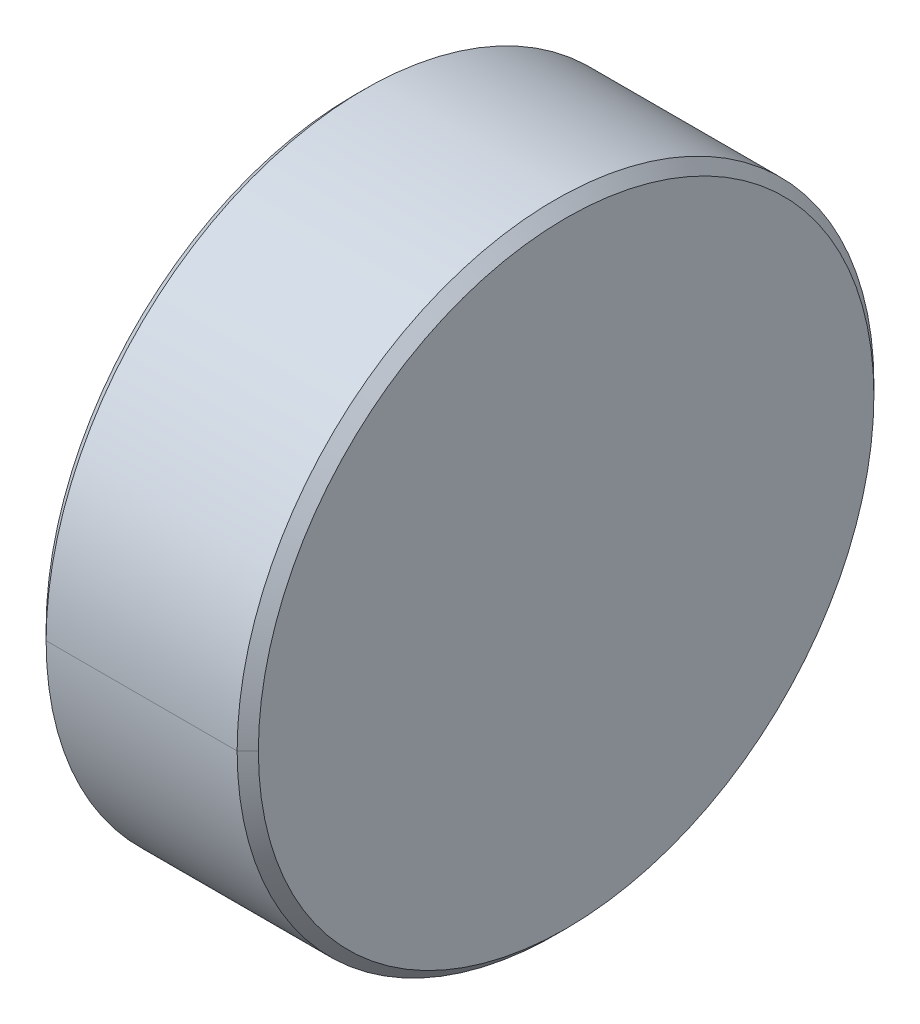
ISO-10303-21;
HEADER;
FILE_DESCRIPTION(('STEP AP214'),'2;1');
FILE_NAME('part.step','',(''),(''),'','','');
FILE_SCHEMA(('AUTOMOTIVE_DESIGN { 1 0 10303 214 1 1 1 1 }'));
ENDSEC;
DATA;
#1=APPLICATION_CONTEXT('core data for automotive mechanical design processes');
#2=APPLICATION_PROTOCOL_DEFINITION('international standard','automotive_design',2000,#1);
#3=PRODUCT_CONTEXT('',#1,'mechanical');
#4=PRODUCT('Part','Part','',(#3));
#5=PRODUCT_RELATED_PRODUCT_CATEGORY('part','',(#4));
#6=PRODUCT_DEFINITION_FORMATION('','',#4);
#7=PRODUCT_DEFINITION_CONTEXT('part definition',#1,'design');
#8=PRODUCT_DEFINITION('design','',#6,#7);
#9=PRODUCT_DEFINITION_SHAPE('','',#8);
#10=(LENGTH_UNIT() NAMED_UNIT(*) SI_UNIT(.MILLI.,.METRE.));
#11=(NAMED_UNIT(*) PLANE_ANGLE_UNIT() SI_UNIT($,.RADIAN.));
#12=(NAMED_UNIT(*) SI_UNIT($,.STERADIAN.) SOLID_ANGLE_UNIT());
#13=UNCERTAINTY_MEASURE_WITH_UNIT(LENGTH_MEASURE(1.E-05),#10,'distance_accuracy_value','');
#14=(GEOMETRIC_REPRESENTATION_CONTEXT(3) GLOBAL_UNCERTAINTY_ASSIGNED_CONTEXT((#13)) GLOBAL_UNIT_ASSIGNED_CONTEXT((#10,
#11,#12)) REPRESENTATION_CONTEXT('',''));
#15=CARTESIAN_POINT('',(0.,0.,0.));
#16=DIRECTION('',(0.,0.,1.));
#17=DIRECTION('',(1.,0.,0.));
#18=AXIS2_PLACEMENT_3D('',#15,#16,#17);
#19=CARTESIAN_POINT('',(0.95,0.,0.));
#20=DIRECTION('',(-1.,0.,0.));
#21=DIRECTION('',(0.,-1.,0.));
#22=AXIS2_PLACEMENT_3D('',#19,#20,#21);
#23=CONICAL_SURFACE('',#22,1.5,0.7853981634);
#24=CARTESIAN_POINT('',(1.,0.,0.));
#25=DIRECTION('',(1.,0.,0.));
#26=DIRECTION('',(0.,0.,-1.));
#27=AXIS2_PLACEMENT_3D('',#24,#25,#26);
#28=CIRCLE('',#27,1.45);
#29=CARTESIAN_POINT('',(1.,0.,-1.45));
#30=VERTEX_POINT('',#29);
#31=CARTESIAN_POINT('',(0.999999999999873,0.,1.44999999999987));
#32=VERTEX_POINT('',#31);
#33=EDGE_CURVE('E11',#30,#32,#28,.T.);
#34=ORIENTED_EDGE('',*,*,#33,.F.);
#35=DIRECTION('',(-0.707106781184743,0.,-0.707106781188352));
#36=VECTOR('',#35,1.);
#37=CARTESIAN_POINT('',(0.999999999999873,0.,-1.44999999999987));
#38=LINE('',#37,#36);
#39=CARTESIAN_POINT('',(0.95,0.,-1.5));
#40=VERTEX_POINT('',#39);
#41=EDGE_CURVE('E24',#30,#40,#38,.T.);
#42=ORIENTED_EDGE('',*,*,#41,.T.);
#43=CARTESIAN_POINT('',(0.95,0.,0.));
#44=DIRECTION('',(1.,0.,0.));
#45=DIRECTION('',(0.,0.,-1.));
#46=AXIS2_PLACEMENT_3D('',#43,#44,#45);
#47=CIRCLE('',#46,1.5);
#48=CARTESIAN_POINT('',(0.95,0.,1.5));
#49=VERTEX_POINT('',#48);
#50=EDGE_CURVE('E110',#40,#49,#47,.T.);
#51=ORIENTED_EDGE('',*,*,#50,.T.);
#52=DIRECTION('',(-0.707106781184743,0.,0.707106781188352));
#53=VECTOR('',#52,1.);
#54=CARTESIAN_POINT('',(0.999999999999873,0.,1.44999999999987));
#55=LINE('',#54,#53);
#56=EDGE_CURVE('E105',#32,#49,#55,.T.);
#57=ORIENTED_EDGE('',*,*,#56,.F.);
#58=EDGE_LOOP('',(#34,#42,#51,#57));
#59=FACE_BOUND('',#58,.T.);
#60=ADVANCED_FACE('F16',(#59),#23,.T.);
#61=CARTESIAN_POINT('',(0.95,0.,0.));
#62=DIRECTION('',(-1.,0.,0.));
#63=DIRECTION('',(0.,1.,0.));
#64=AXIS2_PLACEMENT_3D('',#61,#62,#63);
#65=CONICAL_SURFACE('',#64,1.5,0.7853981634);
#66=CARTESIAN_POINT('',(0.95,0.,0.));
#67=DIRECTION('',(1.,0.,0.));
#68=DIRECTION('',(0.,0.,-1.));
#69=AXIS2_PLACEMENT_3D('',#66,#67,#68);
#70=CIRCLE('',#69,1.5);
#71=EDGE_CURVE('E101',#49,#40,#70,.T.);
#72=ORIENTED_EDGE('',*,*,#71,.T.);
#73=ORIENTED_EDGE('',*,*,#41,.F.);
#74=CARTESIAN_POINT('',(1.,0.,0.));
#75=DIRECTION('',(1.,0.,0.));
#76=DIRECTION('',(0.,0.,-1.));
#77=AXIS2_PLACEMENT_3D('',#74,#75,#76);
#78=CIRCLE('',#77,1.45);
#79=EDGE_CURVE('E96',#32,#30,#78,.T.);
#80=ORIENTED_EDGE('',*,*,#79,.F.);
#81=ORIENTED_EDGE('',*,*,#56,.T.);
#82=EDGE_LOOP('',(#72,#73,#80,#81));
#83=FACE_BOUND('',#82,.T.);
#84=ADVANCED_FACE('F124',(#83),#65,.T.);
#85=CARTESIAN_POINT('',(1.,1.45,0.));
#86=DIRECTION('',(-1.,0.,0.));
#87=DIRECTION('',(0.,0.,1.));
#88=AXIS2_PLACEMENT_3D('',#85,#86,#87);
#89=PLANE('',#88);
#90=ORIENTED_EDGE('',*,*,#33,.T.);
#91=ORIENTED_EDGE('',*,*,#79,.T.);
#92=EDGE_LOOP('',(#90,#91));
#93=FACE_BOUND('',#92,.T.);
#94=ADVANCED_FACE('F137',(#93),#89,.F.);
#95=CARTESIAN_POINT('',(1.,0.,0.));
#96=DIRECTION('',(-1.,0.,0.));
#97=DIRECTION('',(0.,1.,0.));
#98=AXIS2_PLACEMENT_3D('',#95,#96,#97);
#99=CYLINDRICAL_SURFACE('',#98,1.5);
#100=CARTESIAN_POINT('',(0.05,0.,0.));
#101=DIRECTION('',(1.,0.,0.));
#102=DIRECTION('',(0.,0.,-1.));
#103=AXIS2_PLACEMENT_3D('',#100,#101,#102);
#104=CIRCLE('',#103,1.5);
#105=CARTESIAN_POINT('',(0.05,0.,1.5));
#106=VERTEX_POINT('',#105);
#107=CARTESIAN_POINT('',(0.05,0.,-1.5));
#108=VERTEX_POINT('',#107);
#109=EDGE_CURVE('E67',#106,#108,#104,.T.);
#110=ORIENTED_EDGE('',*,*,#109,.T.);
#111=DIRECTION('',(-1.,0.,0.));
#112=VECTOR('',#111,1.);
#113=CARTESIAN_POINT('',(0.95,0.,-1.5));
#114=LINE('',#113,#112);
#115=EDGE_CURVE('E88',#40,#108,#114,.T.);
#116=ORIENTED_EDGE('',*,*,#115,.F.);
#117=ORIENTED_EDGE('',*,*,#71,.F.);
#118=DIRECTION('',(-1.,0.,0.));
#119=VECTOR('',#118,1.);
#120=CARTESIAN_POINT('',(0.95,0.,1.5));
#121=LINE('',#120,#119);
#122=EDGE_CURVE('E84',#49,#106,#121,.T.);
#123=ORIENTED_EDGE('',*,*,#122,.T.);
#124=EDGE_LOOP('',(#110,#116,#117,#123));
#125=FACE_BOUND('',#124,.T.);
#126=ADVANCED_FACE('F127',(#125),#99,.T.);
#127=CARTESIAN_POINT('',(1.,0.,0.));
#128=DIRECTION('',(-1.,0.,0.));
#129=DIRECTION('',(0.,-1.,0.));
#130=AXIS2_PLACEMENT_3D('',#127,#128,#129);
#131=CYLINDRICAL_SURFACE('',#130,1.5);
#132=ORIENTED_EDGE('',*,*,#50,.F.);
#133=ORIENTED_EDGE('',*,*,#115,.T.);
#134=CARTESIAN_POINT('',(0.05,0.,0.));
#135=DIRECTION('',(1.,0.,0.));
#136=DIRECTION('',(0.,0.,-1.));
#137=AXIS2_PLACEMENT_3D('',#134,#135,#136);
#138=CIRCLE('',#137,1.5);
#139=EDGE_CURVE('E79',#108,#106,#138,.T.);
#140=ORIENTED_EDGE('',*,*,#139,.T.);
#141=ORIENTED_EDGE('',*,*,#122,.F.);
#142=EDGE_LOOP('',(#132,#133,#140,#141));
#143=FACE_BOUND('',#142,.T.);
#144=ADVANCED_FACE('F128',(#143),#131,.T.);
#145=CARTESIAN_POINT('',(0.,0.,0.));
#146=DIRECTION('',(1.,0.,0.));
#147=DIRECTION('',(0.,-1.,0.));
#148=AXIS2_PLACEMENT_3D('',#145,#146,#147);
#149=CONICAL_SURFACE('',#148,1.45,0.7853981634);
#150=ORIENTED_EDGE('',*,*,#139,.F.);
#151=DIRECTION('',(0.707106781184742,0.,-0.707106781188353));
#152=VECTOR('',#151,1.);
#153=CARTESIAN_POINT('',(0.,0.,-1.45));
#154=LINE('',#153,#152);
#155=CARTESIAN_POINT('',(0.,0.,-1.45));
#156=VERTEX_POINT('',#155);
#157=EDGE_CURVE('E59',#156,#108,#154,.T.);
#158=ORIENTED_EDGE('',*,*,#157,.F.);
#159=CARTESIAN_POINT('',(0.,0.,0.));
#160=DIRECTION('',(1.,0.,0.));
#161=DIRECTION('',(0.,0.,-1.));
#162=AXIS2_PLACEMENT_3D('',#159,#160,#161);
#163=CIRCLE('',#162,1.45);
#164=CARTESIAN_POINT('',(0.,0.,1.45));
#165=VERTEX_POINT('',#164);
#166=EDGE_CURVE('E52',#156,#165,#163,.T.);
#167=ORIENTED_EDGE('',*,*,#166,.T.);
#168=DIRECTION('',(0.707106781184742,0.,0.707106781188353));
#169=VECTOR('',#168,1.);
#170=CARTESIAN_POINT('',(0.,0.,1.45));
#171=LINE('',#170,#169);
#172=EDGE_CURVE('E56',#165,#106,#171,.T.);
#173=ORIENTED_EDGE('',*,*,#172,.T.);
#174=EDGE_LOOP('',(#150,#158,#167,#173));
#175=FACE_BOUND('',#174,.T.);
#176=ADVANCED_FACE('F55',(#175),#149,.T.);
#177=CARTESIAN_POINT('',(0.,0.,0.));
#178=DIRECTION('',(1.,0.,0.));
#179=DIRECTION('',(0.,1.,0.));
#180=AXIS2_PLACEMENT_3D('',#177,#178,#179);
#181=CONICAL_SURFACE('',#180,1.45,0.7853981634);
#182=CARTESIAN_POINT('',(0.,0.,0.));
#183=DIRECTION('',(1.,0.,0.));
#184=DIRECTION('',(0.,0.,-1.));
#185=AXIS2_PLACEMENT_3D('',#182,#183,#184);
#186=CIRCLE('',#185,1.45);
#187=EDGE_CURVE('E66',#165,#156,#186,.T.);
#188=ORIENTED_EDGE('',*,*,#187,.T.);
#189=ORIENTED_EDGE('',*,*,#157,.T.);
#190=ORIENTED_EDGE('',*,*,#109,.F.);
#191=ORIENTED_EDGE('',*,*,#172,.F.);
#192=EDGE_LOOP('',(#188,#189,#190,#191));
#193=FACE_BOUND('',#192,.T.);
#194=ADVANCED_FACE('F65',(#193),#181,.T.);
#195=CARTESIAN_POINT('',(0.,0.,0.));
#196=DIRECTION('',(1.,0.,0.));
#197=DIRECTION('',(0.,0.,-1.));
#198=AXIS2_PLACEMENT_3D('',#195,#196,#197);
#199=PLANE('',#198);
#200=ORIENTED_EDGE('',*,*,#166,.F.);
#201=ORIENTED_EDGE('',*,*,#187,.F.);
#202=EDGE_LOOP('',(#200,#201));
#203=FACE_BOUND('',#202,.T.);
#204=ADVANCED_FACE('F69',(#203),#199,.F.);
#205=CLOSED_SHELL('',(#60,#84,#94,#126,#144,#176,#194,#204));
#206=MANIFOLD_SOLID_BREP('B1',#205);
#207=ADVANCED_BREP_SHAPE_REPRESENTATION('',(#18,#206),#14);
#208=SHAPE_DEFINITION_REPRESENTATION(#9,#207);
ENDSEC;
END-ISO-10303-21;
